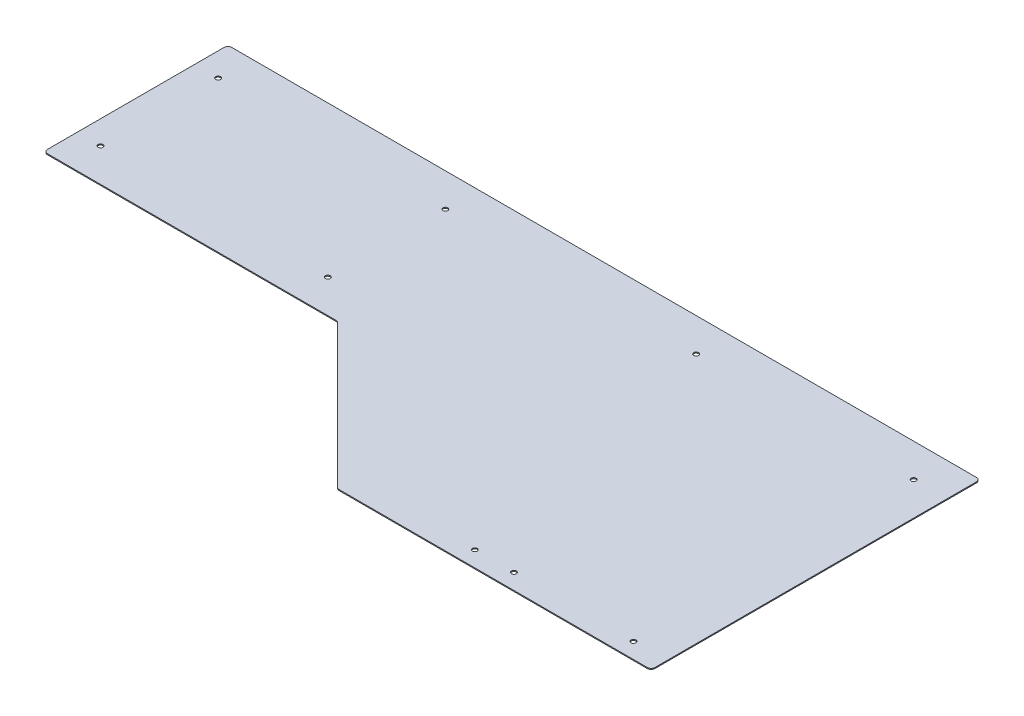
ISO-10303-21;
HEADER;
FILE_DESCRIPTION(('STEP AP214'),'2;1');
FILE_NAME('part.step','',(''),(''),'','','');
FILE_SCHEMA(('AUTOMOTIVE_DESIGN { 1 0 10303 214 1 1 1 1 }'));
ENDSEC;
DATA;
#1=APPLICATION_CONTEXT('core data for automotive mechanical design processes');
#2=APPLICATION_PROTOCOL_DEFINITION('international standard','automotive_design',2000,#1);
#3=PRODUCT_CONTEXT('',#1,'mechanical');
#4=PRODUCT('Part','Part','',(#3));
#5=PRODUCT_RELATED_PRODUCT_CATEGORY('part','',(#4));
#6=PRODUCT_DEFINITION_FORMATION('','',#4);
#7=PRODUCT_DEFINITION_CONTEXT('part definition',#1,'design');
#8=PRODUCT_DEFINITION('design','',#6,#7);
#9=PRODUCT_DEFINITION_SHAPE('','',#8);
#10=(LENGTH_UNIT() NAMED_UNIT(*) SI_UNIT(.MILLI.,.METRE.));
#11=(NAMED_UNIT(*) PLANE_ANGLE_UNIT() SI_UNIT($,.RADIAN.));
#12=(NAMED_UNIT(*) SI_UNIT($,.STERADIAN.) SOLID_ANGLE_UNIT());
#13=UNCERTAINTY_MEASURE_WITH_UNIT(LENGTH_MEASURE(1.E-05),#10,'distance_accuracy_value','');
#14=(GEOMETRIC_REPRESENTATION_CONTEXT(3) GLOBAL_UNCERTAINTY_ASSIGNED_CONTEXT((#13)) GLOBAL_UNIT_ASSIGNED_CONTEXT((#10,
#11,#12)) REPRESENTATION_CONTEXT('',''));
#15=CARTESIAN_POINT('',(0.,0.,0.));
#16=DIRECTION('',(0.,0.,1.));
#17=DIRECTION('',(1.,0.,0.));
#18=AXIS2_PLACEMENT_3D('',#15,#16,#17);
#19=CARTESIAN_POINT('',(-505.369743878931,1.5875,-6.35));
#20=DIRECTION('',(0.,-1.,0.));
#21=DIRECTION('',(0.,0.,-1.));
#22=AXIS2_PLACEMENT_3D('',#19,#20,#21);
#23=CYLINDRICAL_SURFACE('',#22,6.35000000000002);
#24=CARTESIAN_POINT('',(-505.369743878931,0.,-6.35));
#25=DIRECTION('',(0.,1.,0.));
#26=DIRECTION('',(0.,0.,-1.));
#27=AXIS2_PLACEMENT_3D('',#24,#25,#26);
#28=CIRCLE('',#27,6.35000000000002);
#29=CARTESIAN_POINT('',(-509.859871939465,0.,-1.8598719394654));
#30=VERTEX_POINT('',#29);
#31=CARTESIAN_POINT('',(-505.369743878931,0.,0.));
#32=VERTEX_POINT('',#31);
#33=EDGE_CURVE('E149',#30,#32,#28,.T.);
#34=ORIENTED_EDGE('',*,*,#33,.T.);
#35=DIRECTION('',(0.,-1.,0.));
#36=VECTOR('',#35,1.);
#37=CARTESIAN_POINT('',(-505.369743878931,1.5875,0.));
#38=LINE('',#37,#36);
#39=CARTESIAN_POINT('',(-505.369743878931,1.5875,0.));
#40=VERTEX_POINT('',#39);
#41=EDGE_CURVE('E131',#40,#32,#38,.T.);
#42=ORIENTED_EDGE('',*,*,#41,.F.);
#43=CARTESIAN_POINT('',(-505.369743878931,1.5875,-6.35));
#44=DIRECTION('',(0.,1.,0.));
#45=DIRECTION('',(0.,0.,-1.));
#46=AXIS2_PLACEMENT_3D('',#43,#44,#45);
#47=CIRCLE('',#46,6.35000000000002);
#48=CARTESIAN_POINT('',(-509.859871939465,1.5875,-1.8598719394654));
#49=VERTEX_POINT('',#48);
#50=EDGE_CURVE('E136',#49,#40,#47,.T.);
#51=ORIENTED_EDGE('',*,*,#50,.F.);
#52=DIRECTION('',(0.,-1.,0.));
#53=VECTOR('',#52,1.);
#54=CARTESIAN_POINT('',(-509.859871939465,1.5875,-1.8598719394654));
#55=LINE('',#54,#53);
#56=EDGE_CURVE('E219',#49,#30,#55,.T.);
#57=ORIENTED_EDGE('',*,*,#56,.T.);
#58=EDGE_LOOP('',(#34,#42,#51,#57));
#59=FACE_BOUND('',#58,.T.);
#60=ADVANCED_FACE('F36',(#59),#23,.T.);
#61=CARTESIAN_POINT('',(-505.369743878931,1.5875,0.));
#62=DIRECTION('',(0.,0.,-1.));
#63=DIRECTION('',(-1.,0.,0.));
#64=AXIS2_PLACEMENT_3D('',#61,#62,#63);
#65=PLANE('',#64);
#66=DIRECTION('',(1.,0.,0.));
#67=VECTOR('',#66,1.);
#68=CARTESIAN_POINT('',(-505.369743878931,0.,0.));
#69=LINE('',#68,#67);
#70=CARTESIAN_POINT('',(-6.35000000000002,0.,0.));
#71=VERTEX_POINT('',#70);
#72=EDGE_CURVE('E211',#32,#71,#69,.T.);
#73=ORIENTED_EDGE('',*,*,#72,.T.);
#74=DIRECTION('',(0.,-1.,0.));
#75=VECTOR('',#74,1.);
#76=CARTESIAN_POINT('',(-6.35000000000002,1.5875,0.));
#77=LINE('',#76,#75);
#78=CARTESIAN_POINT('',(-6.35000000000002,1.5875,0.));
#79=VERTEX_POINT('',#78);
#80=EDGE_CURVE('E11',#71,#79,#77,.F.);
#81=ORIENTED_EDGE('',*,*,#80,.T.);
#82=DIRECTION('',(1.,0.,0.));
#83=VECTOR('',#82,1.);
#84=CARTESIAN_POINT('',(-505.369743878931,1.5875,0.));
#85=LINE('',#84,#83);
#86=EDGE_CURVE('E126',#40,#79,#85,.T.);
#87=ORIENTED_EDGE('',*,*,#86,.F.);
#88=ORIENTED_EDGE('',*,*,#41,.T.);
#89=EDGE_LOOP('',(#73,#81,#87,#88));
#90=FACE_BOUND('',#89,.T.);
#91=ADVANCED_FACE('F129',(#90),#65,.F.);
#92=CARTESIAN_POINT('',(0.,1.5875,0.));
#93=DIRECTION('',(-1.,0.,0.));
#94=DIRECTION('',(0.,0.,1.));
#95=AXIS2_PLACEMENT_3D('',#92,#93,#94);
#96=PLANE('',#95);
#97=DIRECTION('',(0.,0.,-1.));
#98=VECTOR('',#97,1.);
#99=CARTESIAN_POINT('',(0.,0.,0.));
#100=LINE('',#99,#98);
#101=CARTESIAN_POINT('',(0.,0.,-6.35));
#102=VERTEX_POINT('',#101);
#103=CARTESIAN_POINT('',(0.,0.,-527.05));
#104=VERTEX_POINT('',#103);
#105=EDGE_CURVE('E193',#102,#104,#100,.T.);
#106=ORIENTED_EDGE('',*,*,#105,.T.);
#107=DIRECTION('',(0.,-1.,0.));
#108=VECTOR('',#107,1.);
#109=CARTESIAN_POINT('',(0.,1.5875,-527.05));
#110=LINE('',#109,#108);
#111=CARTESIAN_POINT('',(0.,1.5875,-527.05));
#112=VERTEX_POINT('',#111);
#113=EDGE_CURVE('E44',#104,#112,#110,.F.);
#114=ORIENTED_EDGE('',*,*,#113,.T.);
#115=DIRECTION('',(0.,0.,-1.));
#116=VECTOR('',#115,1.);
#117=CARTESIAN_POINT('',(0.,1.5875,0.));
#118=LINE('',#117,#116);
#119=CARTESIAN_POINT('',(0.,1.5875,-6.35));
#120=VERTEX_POINT('',#119);
#121=EDGE_CURVE('E135',#120,#112,#118,.T.);
#122=ORIENTED_EDGE('',*,*,#121,.F.);
#123=DIRECTION('',(0.,-1.,0.));
#124=VECTOR('',#123,1.);
#125=CARTESIAN_POINT('',(0.,1.5875,-6.35));
#126=LINE('',#125,#124);
#127=EDGE_CURVE('E184',#120,#102,#126,.T.);
#128=ORIENTED_EDGE('',*,*,#127,.T.);
#129=EDGE_LOOP('',(#106,#114,#122,#128));
#130=FACE_BOUND('',#129,.T.);
#131=ADVANCED_FACE('F190',(#130),#96,.F.);
#132=CARTESIAN_POINT('',(-1219.2,1.5875,-533.4));
#133=DIRECTION('',(0.,0.,1.));
#134=DIRECTION('',(1.,0.,0.));
#135=AXIS2_PLACEMENT_3D('',#132,#133,#134);
#136=PLANE('',#135);
#137=DIRECTION('',(-1.,0.,0.));
#138=VECTOR('',#137,1.);
#139=CARTESIAN_POINT('',(-1219.2,1.5875,-533.4));
#140=LINE('',#139,#138);
#141=CARTESIAN_POINT('',(-6.35000000000052,1.5875,-533.4));
#142=VERTEX_POINT('',#141);
#143=CARTESIAN_POINT('',(-1212.85,1.5875,-533.4));
#144=VERTEX_POINT('',#143);
#145=EDGE_CURVE('E195',#142,#144,#140,.T.);
#146=ORIENTED_EDGE('',*,*,#145,.F.);
#147=DIRECTION('',(0.,-1.,0.));
#148=VECTOR('',#147,1.);
#149=CARTESIAN_POINT('',(-6.35000000000008,1.5875,-533.4));
#150=LINE('',#149,#148);
#151=CARTESIAN_POINT('',(-6.35000000000052,0.,-533.4));
#152=VERTEX_POINT('',#151);
#153=EDGE_CURVE('E181',#142,#152,#150,.T.);
#154=ORIENTED_EDGE('',*,*,#153,.T.);
#155=DIRECTION('',(-1.,0.,0.));
#156=VECTOR('',#155,1.);
#157=CARTESIAN_POINT('',(-1219.2,0.,-533.4));
#158=LINE('',#157,#156);
#159=CARTESIAN_POINT('',(-1212.85,0.,-533.4));
#160=VERTEX_POINT('',#159);
#161=EDGE_CURVE('E201',#152,#160,#158,.T.);
#162=ORIENTED_EDGE('',*,*,#161,.T.);
#163=DIRECTION('',(0.,-1.,0.));
#164=VECTOR('',#163,1.);
#165=CARTESIAN_POINT('',(-1212.85,1.5875,-533.4));
#166=LINE('',#165,#164);
#167=EDGE_CURVE('E51',#160,#144,#166,.F.);
#168=ORIENTED_EDGE('',*,*,#167,.T.);
#169=EDGE_LOOP('',(#146,#154,#162,#168));
#170=FACE_BOUND('',#169,.T.);
#171=ADVANCED_FACE('F200',(#170),#136,.F.);
#172=CARTESIAN_POINT('',(-1219.2,1.5875,-234.95));
#173=DIRECTION('',(1.,0.,0.));
#174=DIRECTION('',(0.,0.,-1.));
#175=AXIS2_PLACEMENT_3D('',#172,#173,#174);
#176=PLANE('',#175);
#177=DIRECTION('',(0.,0.,1.));
#178=VECTOR('',#177,1.);
#179=CARTESIAN_POINT('',(-1219.2,0.,-234.95));
#180=LINE('',#179,#178);
#181=CARTESIAN_POINT('',(-1219.2,0.,-527.05));
#182=VERTEX_POINT('',#181);
#183=CARTESIAN_POINT('',(-1219.2,0.,-241.3));
#184=VERTEX_POINT('',#183);
#185=EDGE_CURVE('E206',#182,#184,#180,.T.);
#186=ORIENTED_EDGE('',*,*,#185,.T.);
#187=DIRECTION('',(0.,-1.,0.));
#188=VECTOR('',#187,1.);
#189=CARTESIAN_POINT('',(-1219.2,1.5875,-241.3));
#190=LINE('',#189,#188);
#191=CARTESIAN_POINT('',(-1219.2,1.5875,-241.3));
#192=VERTEX_POINT('',#191);
#193=EDGE_CURVE('E171',#184,#192,#190,.F.);
#194=ORIENTED_EDGE('',*,*,#193,.T.);
#195=DIRECTION('',(0.,0.,1.));
#196=VECTOR('',#195,1.);
#197=CARTESIAN_POINT('',(-1219.2,1.5875,-234.95));
#198=LINE('',#197,#196);
#199=CARTESIAN_POINT('',(-1219.2,1.5875,-527.05));
#200=VERTEX_POINT('',#199);
#201=EDGE_CURVE('E239',#200,#192,#198,.T.);
#202=ORIENTED_EDGE('',*,*,#201,.F.);
#203=DIRECTION('',(0.,-1.,0.));
#204=VECTOR('',#203,1.);
#205=CARTESIAN_POINT('',(-1219.2,1.5875,-527.05));
#206=LINE('',#205,#204);
#207=EDGE_CURVE('E168',#200,#182,#206,.T.);
#208=ORIENTED_EDGE('',*,*,#207,.T.);
#209=EDGE_LOOP('',(#186,#194,#202,#208));
#210=FACE_BOUND('',#209,.T.);
#211=ADVANCED_FACE('F356',(#210),#176,.F.);
#212=CARTESIAN_POINT('',(-1219.2,1.5875,-234.95));
#213=DIRECTION('',(0.,0.,-1.));
#214=DIRECTION('',(-1.,0.,0.));
#215=AXIS2_PLACEMENT_3D('',#212,#213,#214);
#216=PLANE('',#215);
#217=DIRECTION('',(1.,0.,0.));
#218=VECTOR('',#217,1.);
#219=CARTESIAN_POINT('',(-1219.2,1.5875,-234.95));
#220=LINE('',#219,#218);
#221=CARTESIAN_POINT('',(-1212.85,1.5875,-234.95));
#222=VERTEX_POINT('',#221);
#223=CARTESIAN_POINT('',(-745.580256121068,1.5875,-234.95));
#224=VERTEX_POINT('',#223);
#225=EDGE_CURVE('E237',#222,#224,#220,.T.);
#226=ORIENTED_EDGE('',*,*,#225,.F.);
#227=DIRECTION('',(0.,-1.,0.));
#228=VECTOR('',#227,1.);
#229=CARTESIAN_POINT('',(-1212.85,1.5875,-234.95));
#230=LINE('',#229,#228);
#231=CARTESIAN_POINT('',(-1212.85,0.,-234.95));
#232=VERTEX_POINT('',#231);
#233=EDGE_CURVE('E150',#222,#232,#230,.T.);
#234=ORIENTED_EDGE('',*,*,#233,.T.);
#235=DIRECTION('',(1.,0.,0.));
#236=VECTOR('',#235,1.);
#237=CARTESIAN_POINT('',(-1219.2,0.,-234.95));
#238=LINE('',#237,#236);
#239=CARTESIAN_POINT('',(-745.580256121068,0.,-234.95));
#240=VERTEX_POINT('',#239);
#241=EDGE_CURVE('E209',#232,#240,#238,.T.);
#242=ORIENTED_EDGE('',*,*,#241,.T.);
#243=DIRECTION('',(0.,-1.,0.));
#244=VECTOR('',#243,1.);
#245=CARTESIAN_POINT('',(-745.580256121068,1.5875,-234.95));
#246=LINE('',#245,#244);
#247=EDGE_CURVE('E151',#224,#240,#246,.T.);
#248=ORIENTED_EDGE('',*,*,#247,.F.);
#249=EDGE_LOOP('',(#226,#234,#242,#248));
#250=FACE_BOUND('',#249,.T.);
#251=ADVANCED_FACE('F362',(#250),#216,.F.);
#252=CARTESIAN_POINT('',(-745.580256121068,1.5875,-228.6));
#253=DIRECTION('',(0.,-1.,0.));
#254=DIRECTION('',(0.,0.,-1.));
#255=AXIS2_PLACEMENT_3D('',#252,#253,#254);
#256=CYLINDRICAL_SURFACE('',#255,6.35);
#257=CARTESIAN_POINT('',(-745.580256121068,0.,-228.6));
#258=DIRECTION('',(0.,-1.,0.));
#259=DIRECTION('',(0.,0.,1.));
#260=AXIS2_PLACEMENT_3D('',#257,#258,#259);
#261=CIRCLE('',#260,6.35);
#262=CARTESIAN_POINT('',(-741.090128060534,0.,-233.090128060535));
#263=VERTEX_POINT('',#262);
#264=EDGE_CURVE('E216',#240,#263,#261,.T.);
#265=ORIENTED_EDGE('',*,*,#264,.T.);
#266=DIRECTION('',(0.,-1.,0.));
#267=VECTOR('',#266,1.);
#268=CARTESIAN_POINT('',(-741.090128060534,1.5875,-233.090128060535));
#269=LINE('',#268,#267);
#270=CARTESIAN_POINT('',(-741.090128060534,1.5875,-233.090128060535));
#271=VERTEX_POINT('',#270);
#272=EDGE_CURVE('E157',#271,#263,#269,.T.);
#273=ORIENTED_EDGE('',*,*,#272,.F.);
#274=CARTESIAN_POINT('',(-745.580256121068,1.5875,-228.6));
#275=DIRECTION('',(0.,-1.,0.));
#276=DIRECTION('',(0.,0.,1.));
#277=AXIS2_PLACEMENT_3D('',#274,#275,#276);
#278=CIRCLE('',#277,6.35);
#279=EDGE_CURVE('E235',#224,#271,#278,.T.);
#280=ORIENTED_EDGE('',*,*,#279,.F.);
#281=ORIENTED_EDGE('',*,*,#247,.T.);
#282=EDGE_LOOP('',(#265,#273,#280,#281));
#283=FACE_BOUND('',#282,.T.);
#284=ADVANCED_FACE('F363',(#283),#256,.F.);
#285=CARTESIAN_POINT('',(-741.090128060534,1.5875,-233.090128060535));
#286=DIRECTION('',(0.707106781186549,0.,-0.707106781186546));
#287=DIRECTION('',(-0.707106781186546,0.,-0.707106781186549));
#288=AXIS2_PLACEMENT_3D('',#285,#286,#287);
#289=PLANE('',#288);
#290=DIRECTION('',(0.707106781186546,0.,0.707106781186549));
#291=VECTOR('',#290,1.);
#292=CARTESIAN_POINT('',(-741.090128060534,0.,-233.090128060535));
#293=LINE('',#292,#291);
#294=EDGE_CURVE('E146',#263,#30,#293,.T.);
#295=ORIENTED_EDGE('',*,*,#294,.T.);
#296=ORIENTED_EDGE('',*,*,#56,.F.);
#297=DIRECTION('',(0.707106781186546,0.,0.707106781186549));
#298=VECTOR('',#297,1.);
#299=CARTESIAN_POINT('',(-741.090128060534,1.5875,-233.090128060535));
#300=LINE('',#299,#298);
#301=EDGE_CURVE('E142',#271,#49,#300,.T.);
#302=ORIENTED_EDGE('',*,*,#301,.F.);
#303=ORIENTED_EDGE('',*,*,#272,.T.);
#304=EDGE_LOOP('',(#295,#296,#302,#303));
#305=FACE_BOUND('',#304,.T.);
#306=ADVANCED_FACE('F224',(#305),#289,.F.);
#307=CARTESIAN_POINT('',(-505.369743878931,1.5875,-6.35));
#308=DIRECTION('',(0.,-1.,0.));
#309=DIRECTION('',(0.,0.,-1.));
#310=AXIS2_PLACEMENT_3D('',#307,#308,#309);
#311=PLANE('',#310);
#312=CARTESIAN_POINT('',(-1181.1,1.5875,-479.425));
#313=DIRECTION('',(0.,1.,0.));
#314=DIRECTION('',(0.,0.,1.));
#315=AXIS2_PLACEMENT_3D('',#312,#313,#314);
#316=CIRCLE('',#315,3.96875000000008);
#317=CARTESIAN_POINT('',(-1181.1,1.5875,-475.45625));
#318=VERTEX_POINT('',#317);
#319=EDGE_CURVE('E289',#318,#318,#316,.T.);
#320=ORIENTED_EDGE('',*,*,#319,.F.);
#321=EDGE_LOOP('',(#320));
#322=FACE_BOUND('',#321,.T.);
#323=CARTESIAN_POINT('',(-1181.1,1.5875,-288.925));
#324=DIRECTION('',(0.,1.,0.));
#325=DIRECTION('',(0.,0.,1.));
#326=AXIS2_PLACEMENT_3D('',#323,#324,#325);
#327=CIRCLE('',#326,3.96875000000008);
#328=CARTESIAN_POINT('',(-1181.1,1.5875,-284.95625));
#329=VERTEX_POINT('',#328);
#330=EDGE_CURVE('E283',#329,#329,#327,.T.);
#331=ORIENTED_EDGE('',*,*,#330,.F.);
#332=EDGE_LOOP('',(#331));
#333=FACE_BOUND('',#332,.T.);
#334=CARTESIAN_POINT('',(-812.8,1.5875,-288.925));
#335=DIRECTION('',(0.,1.,0.));
#336=DIRECTION('',(0.,0.,1.));
#337=AXIS2_PLACEMENT_3D('',#334,#335,#336);
#338=CIRCLE('',#337,3.96874999999997);
#339=CARTESIAN_POINT('',(-812.8,1.5875,-284.95625));
#340=VERTEX_POINT('',#339);
#341=EDGE_CURVE('E277',#340,#340,#338,.T.);
#342=ORIENTED_EDGE('',*,*,#341,.F.);
#343=EDGE_LOOP('',(#342));
#344=FACE_BOUND('',#343,.T.);
#345=CARTESIAN_POINT('',(-812.8,1.5875,-479.425));
#346=DIRECTION('',(0.,1.,0.));
#347=DIRECTION('',(0.,0.,1.));
#348=AXIS2_PLACEMENT_3D('',#345,#346,#347);
#349=CIRCLE('',#348,3.96874999999997);
#350=CARTESIAN_POINT('',(-812.8,1.5875,-475.45625));
#351=VERTEX_POINT('',#350);
#352=EDGE_CURVE('E271',#351,#351,#349,.T.);
#353=ORIENTED_EDGE('',*,*,#352,.F.);
#354=EDGE_LOOP('',(#353));
#355=FACE_BOUND('',#354,.T.);
#356=CARTESIAN_POINT('',(-406.4,1.5875,-479.425));
#357=DIRECTION('',(0.,1.,0.));
#358=DIRECTION('',(0.,0.,1.));
#359=AXIS2_PLACEMENT_3D('',#356,#357,#358);
#360=CIRCLE('',#359,3.96875000000002);
#361=CARTESIAN_POINT('',(-406.4,1.5875,-475.45625));
#362=VERTEX_POINT('',#361);
#363=EDGE_CURVE('E265',#362,#362,#360,.T.);
#364=ORIENTED_EDGE('',*,*,#363,.F.);
#365=EDGE_LOOP('',(#364));
#366=FACE_BOUND('',#365,.T.);
#367=CARTESIAN_POINT('',(-53.975,1.5875,-479.425));
#368=DIRECTION('',(0.,1.,0.));
#369=DIRECTION('',(0.,0.,1.));
#370=AXIS2_PLACEMENT_3D('',#367,#368,#369);
#371=CIRCLE('',#370,3.96874999999999);
#372=CARTESIAN_POINT('',(-53.975,1.5875,-475.45625));
#373=VERTEX_POINT('',#372);
#374=EDGE_CURVE('E259',#373,#373,#371,.T.);
#375=ORIENTED_EDGE('',*,*,#374,.F.);
#376=EDGE_LOOP('',(#375));
#377=FACE_BOUND('',#376,.T.);
#378=CARTESIAN_POINT('',(-53.975,1.5875,-25.4));
#379=DIRECTION('',(0.,1.,0.));
#380=DIRECTION('',(0.,0.,1.));
#381=AXIS2_PLACEMENT_3D('',#378,#379,#380);
#382=CIRCLE('',#381,3.96874999999999);
#383=CARTESIAN_POINT('',(-53.975,1.5875,-21.43125));
#384=VERTEX_POINT('',#383);
#385=EDGE_CURVE('E253',#384,#384,#382,.T.);
#386=ORIENTED_EDGE('',*,*,#385,.F.);
#387=EDGE_LOOP('',(#386));
#388=FACE_BOUND('',#387,.T.);
#389=CARTESIAN_POINT('',(-247.65,1.5875,-25.4));
#390=DIRECTION('',(0.,1.,0.));
#391=DIRECTION('',(0.,0.,1.));
#392=AXIS2_PLACEMENT_3D('',#389,#390,#391);
#393=CIRCLE('',#392,3.96874999999999);
#394=CARTESIAN_POINT('',(-247.65,1.5875,-21.43125));
#395=VERTEX_POINT('',#394);
#396=EDGE_CURVE('E247',#395,#395,#393,.T.);
#397=ORIENTED_EDGE('',*,*,#396,.F.);
#398=EDGE_LOOP('',(#397));
#399=FACE_BOUND('',#398,.T.);
#400=CARTESIAN_POINT('',(-311.15,1.5875,-25.4));
#401=DIRECTION('',(0.,1.,0.));
#402=DIRECTION('',(0.,0.,1.));
#403=AXIS2_PLACEMENT_3D('',#400,#401,#402);
#404=CIRCLE('',#403,3.96875000000002);
#405=CARTESIAN_POINT('',(-311.15,1.5875,-21.43125));
#406=VERTEX_POINT('',#405);
#407=EDGE_CURVE('E231',#406,#406,#404,.T.);
#408=ORIENTED_EDGE('',*,*,#407,.F.);
#409=EDGE_LOOP('',(#408));
#410=FACE_BOUND('',#409,.T.);
#411=ORIENTED_EDGE('',*,*,#201,.T.);
#412=CARTESIAN_POINT('',(-1212.85,1.5875,-241.3));
#413=DIRECTION('',(0.,-1.,0.));
#414=DIRECTION('',(0.,0.,-1.));
#415=AXIS2_PLACEMENT_3D('',#412,#413,#414);
#416=CIRCLE('',#415,6.35);
#417=EDGE_CURVE('E178',#192,#222,#416,.F.);
#418=ORIENTED_EDGE('',*,*,#417,.T.);
#419=ORIENTED_EDGE('',*,*,#225,.T.);
#420=ORIENTED_EDGE('',*,*,#279,.T.);
#421=ORIENTED_EDGE('',*,*,#301,.T.);
#422=ORIENTED_EDGE('',*,*,#50,.T.);
#423=ORIENTED_EDGE('',*,*,#86,.T.);
#424=CARTESIAN_POINT('',(-6.35,1.5875,-6.35));
#425=DIRECTION('',(0.,-1.,0.));
#426=DIRECTION('',(0.,0.,-1.));
#427=AXIS2_PLACEMENT_3D('',#424,#425,#426);
#428=CIRCLE('',#427,6.35);
#429=EDGE_CURVE('E175',#79,#120,#428,.F.);
#430=ORIENTED_EDGE('',*,*,#429,.T.);
#431=ORIENTED_EDGE('',*,*,#121,.T.);
#432=CARTESIAN_POINT('',(-6.35000000000008,1.5875,-527.05));
#433=DIRECTION('',(0.,-1.,0.));
#434=DIRECTION('',(0.,0.,-1.));
#435=AXIS2_PLACEMENT_3D('',#432,#433,#434);
#436=CIRCLE('',#435,6.35);
#437=EDGE_CURVE('E58',#112,#142,#436,.F.);
#438=ORIENTED_EDGE('',*,*,#437,.T.);
#439=ORIENTED_EDGE('',*,*,#145,.T.);
#440=CARTESIAN_POINT('',(-1212.85,1.5875,-527.05));
#441=DIRECTION('',(0.,-1.,0.));
#442=DIRECTION('',(0.,0.,-1.));
#443=AXIS2_PLACEMENT_3D('',#440,#441,#442);
#444=CIRCLE('',#443,6.35);
#445=EDGE_CURVE('E173',#144,#200,#444,.F.);
#446=ORIENTED_EDGE('',*,*,#445,.T.);
#447=EDGE_LOOP('',(#411,#418,#419,#420,#421,#422,#423,#430,#431,#438,#439,#446));
#448=FACE_BOUND('',#447,.T.);
#449=ADVANCED_FACE('F140',(#322,#333,#344,#355,#366,#377,#388,#399,#410,#448),#311,.F.);
#450=CARTESIAN_POINT('',(-505.369743878931,0.,-6.35));
#451=DIRECTION('',(0.,-1.,0.));
#452=DIRECTION('',(0.,0.,-1.));
#453=AXIS2_PLACEMENT_3D('',#450,#451,#452);
#454=PLANE('',#453);
#455=CARTESIAN_POINT('',(-1181.1,0.,-479.425));
#456=DIRECTION('',(0.,1.,0.));
#457=DIRECTION('',(0.,0.,1.));
#458=AXIS2_PLACEMENT_3D('',#455,#456,#457);
#459=CIRCLE('',#458,3.96875000000008);
#460=CARTESIAN_POINT('',(-1181.1,0.,-475.45625));
#461=VERTEX_POINT('',#460);
#462=EDGE_CURVE('E286',#461,#461,#459,.T.);
#463=ORIENTED_EDGE('',*,*,#462,.T.);
#464=EDGE_LOOP('',(#463));
#465=FACE_BOUND('',#464,.T.);
#466=CARTESIAN_POINT('',(-1181.1,0.,-288.925));
#467=DIRECTION('',(0.,1.,0.));
#468=DIRECTION('',(0.,0.,1.));
#469=AXIS2_PLACEMENT_3D('',#466,#467,#468);
#470=CIRCLE('',#469,3.96875000000008);
#471=CARTESIAN_POINT('',(-1181.1,0.,-284.95625));
#472=VERTEX_POINT('',#471);
#473=EDGE_CURVE('E280',#472,#472,#470,.T.);
#474=ORIENTED_EDGE('',*,*,#473,.T.);
#475=EDGE_LOOP('',(#474));
#476=FACE_BOUND('',#475,.T.);
#477=CARTESIAN_POINT('',(-812.8,0.,-288.925));
#478=DIRECTION('',(0.,1.,0.));
#479=DIRECTION('',(0.,0.,1.));
#480=AXIS2_PLACEMENT_3D('',#477,#478,#479);
#481=CIRCLE('',#480,3.96874999999997);
#482=CARTESIAN_POINT('',(-812.8,0.,-284.95625));
#483=VERTEX_POINT('',#482);
#484=EDGE_CURVE('E274',#483,#483,#481,.T.);
#485=ORIENTED_EDGE('',*,*,#484,.T.);
#486=EDGE_LOOP('',(#485));
#487=FACE_BOUND('',#486,.T.);
#488=CARTESIAN_POINT('',(-812.8,0.,-479.425));
#489=DIRECTION('',(0.,1.,0.));
#490=DIRECTION('',(0.,0.,1.));
#491=AXIS2_PLACEMENT_3D('',#488,#489,#490);
#492=CIRCLE('',#491,3.96874999999997);
#493=CARTESIAN_POINT('',(-812.8,0.,-475.45625));
#494=VERTEX_POINT('',#493);
#495=EDGE_CURVE('E268',#494,#494,#492,.T.);
#496=ORIENTED_EDGE('',*,*,#495,.T.);
#497=EDGE_LOOP('',(#496));
#498=FACE_BOUND('',#497,.T.);
#499=CARTESIAN_POINT('',(-406.4,0.,-479.425));
#500=DIRECTION('',(0.,1.,0.));
#501=DIRECTION('',(0.,0.,1.));
#502=AXIS2_PLACEMENT_3D('',#499,#500,#501);
#503=CIRCLE('',#502,3.96875000000002);
#504=CARTESIAN_POINT('',(-406.4,0.,-475.45625));
#505=VERTEX_POINT('',#504);
#506=EDGE_CURVE('E262',#505,#505,#503,.T.);
#507=ORIENTED_EDGE('',*,*,#506,.T.);
#508=EDGE_LOOP('',(#507));
#509=FACE_BOUND('',#508,.T.);
#510=CARTESIAN_POINT('',(-53.975,0.,-479.425));
#511=DIRECTION('',(0.,1.,0.));
#512=DIRECTION('',(0.,0.,1.));
#513=AXIS2_PLACEMENT_3D('',#510,#511,#512);
#514=CIRCLE('',#513,3.96875);
#515=CARTESIAN_POINT('',(-53.975,0.,-475.45625));
#516=VERTEX_POINT('',#515);
#517=EDGE_CURVE('E256',#516,#516,#514,.T.);
#518=ORIENTED_EDGE('',*,*,#517,.T.);
#519=EDGE_LOOP('',(#518));
#520=FACE_BOUND('',#519,.T.);
#521=CARTESIAN_POINT('',(-53.975,0.,-25.4));
#522=DIRECTION('',(0.,1.,0.));
#523=DIRECTION('',(0.,0.,1.));
#524=AXIS2_PLACEMENT_3D('',#521,#522,#523);
#525=CIRCLE('',#524,3.96875);
#526=CARTESIAN_POINT('',(-53.975,0.,-21.43125));
#527=VERTEX_POINT('',#526);
#528=EDGE_CURVE('E250',#527,#527,#525,.T.);
#529=ORIENTED_EDGE('',*,*,#528,.T.);
#530=EDGE_LOOP('',(#529));
#531=FACE_BOUND('',#530,.T.);
#532=CARTESIAN_POINT('',(-247.65,0.,-25.4));
#533=DIRECTION('',(0.,1.,0.));
#534=DIRECTION('',(0.,0.,1.));
#535=AXIS2_PLACEMENT_3D('',#532,#533,#534);
#536=CIRCLE('',#535,3.96874999999999);
#537=CARTESIAN_POINT('',(-247.65,0.,-21.43125));
#538=VERTEX_POINT('',#537);
#539=EDGE_CURVE('E244',#538,#538,#536,.T.);
#540=ORIENTED_EDGE('',*,*,#539,.T.);
#541=EDGE_LOOP('',(#540));
#542=FACE_BOUND('',#541,.T.);
#543=CARTESIAN_POINT('',(-311.15,0.,-25.4));
#544=DIRECTION('',(0.,1.,0.));
#545=DIRECTION('',(0.,0.,1.));
#546=AXIS2_PLACEMENT_3D('',#543,#544,#545);
#547=CIRCLE('',#546,3.96875000000002);
#548=CARTESIAN_POINT('',(-311.15,0.,-21.43125));
#549=VERTEX_POINT('',#548);
#550=EDGE_CURVE('E228',#549,#549,#547,.T.);
#551=ORIENTED_EDGE('',*,*,#550,.T.);
#552=EDGE_LOOP('',(#551));
#553=FACE_BOUND('',#552,.T.);
#554=ORIENTED_EDGE('',*,*,#241,.F.);
#555=CARTESIAN_POINT('',(-1212.85,0.,-241.3));
#556=DIRECTION('',(0.,-1.,0.));
#557=DIRECTION('',(0.,0.,-1.));
#558=AXIS2_PLACEMENT_3D('',#555,#556,#557);
#559=CIRCLE('',#558,6.35);
#560=EDGE_CURVE('E166',#232,#184,#559,.T.);
#561=ORIENTED_EDGE('',*,*,#560,.T.);
#562=ORIENTED_EDGE('',*,*,#185,.F.);
#563=CARTESIAN_POINT('',(-1212.85,0.,-527.05));
#564=DIRECTION('',(0.,-1.,0.));
#565=DIRECTION('',(0.,0.,-1.));
#566=AXIS2_PLACEMENT_3D('',#563,#564,#565);
#567=CIRCLE('',#566,6.35);
#568=EDGE_CURVE('E154',#182,#160,#567,.T.);
#569=ORIENTED_EDGE('',*,*,#568,.T.);
#570=ORIENTED_EDGE('',*,*,#161,.F.);
#571=CARTESIAN_POINT('',(-6.35000000000008,0.,-527.05));
#572=DIRECTION('',(0.,-1.,0.));
#573=DIRECTION('',(0.,0.,-1.));
#574=AXIS2_PLACEMENT_3D('',#571,#572,#573);
#575=CIRCLE('',#574,6.35);
#576=EDGE_CURVE('E164',#152,#104,#575,.T.);
#577=ORIENTED_EDGE('',*,*,#576,.T.);
#578=ORIENTED_EDGE('',*,*,#105,.F.);
#579=CARTESIAN_POINT('',(-6.35,0.,-6.35));
#580=DIRECTION('',(0.,-1.,0.));
#581=DIRECTION('',(0.,0.,-1.));
#582=AXIS2_PLACEMENT_3D('',#579,#580,#581);
#583=CIRCLE('',#582,6.35);
#584=EDGE_CURVE('E162',#102,#71,#583,.T.);
#585=ORIENTED_EDGE('',*,*,#584,.T.);
#586=ORIENTED_EDGE('',*,*,#72,.F.);
#587=ORIENTED_EDGE('',*,*,#33,.F.);
#588=ORIENTED_EDGE('',*,*,#294,.F.);
#589=ORIENTED_EDGE('',*,*,#264,.F.);
#590=EDGE_LOOP('',(#554,#561,#562,#569,#570,#577,#578,#585,#586,#587,#588,#589));
#591=FACE_BOUND('',#590,.T.);
#592=ADVANCED_FACE('F204',(#465,#476,#487,#498,#509,#520,#531,#542,#553,#591),#454,.T.);
#593=CARTESIAN_POINT('',(-311.15,1.5875,-25.4));
#594=DIRECTION('',(0.,1.,0.));
#595=DIRECTION('',(0.,0.,1.));
#596=AXIS2_PLACEMENT_3D('',#593,#594,#595);
#597=CYLINDRICAL_SURFACE('',#596,3.96875000000002);
#598=ORIENTED_EDGE('',*,*,#550,.F.);
#599=EDGE_LOOP('',(#598));
#600=FACE_BOUND('',#599,.T.);
#601=ORIENTED_EDGE('',*,*,#407,.T.);
#602=EDGE_LOOP('',(#601));
#603=FACE_BOUND('',#602,.T.);
#604=ADVANCED_FACE('F314',(#600,#603),#597,.F.);
#605=CARTESIAN_POINT('',(-247.65,1.5875,-25.4));
#606=DIRECTION('',(0.,1.,0.));
#607=DIRECTION('',(0.,0.,1.));
#608=AXIS2_PLACEMENT_3D('',#605,#606,#607);
#609=CYLINDRICAL_SURFACE('',#608,3.96874999999999);
#610=ORIENTED_EDGE('',*,*,#539,.F.);
#611=EDGE_LOOP('',(#610));
#612=FACE_BOUND('',#611,.T.);
#613=ORIENTED_EDGE('',*,*,#396,.T.);
#614=EDGE_LOOP('',(#613));
#615=FACE_BOUND('',#614,.T.);
#616=ADVANCED_FACE('F316',(#612,#615),#609,.F.);
#617=CARTESIAN_POINT('',(-53.975,1.5875,-25.4));
#618=DIRECTION('',(0.,1.,0.));
#619=DIRECTION('',(0.,0.,1.));
#620=AXIS2_PLACEMENT_3D('',#617,#618,#619);
#621=CYLINDRICAL_SURFACE('',#620,3.96875);
#622=ORIENTED_EDGE('',*,*,#528,.F.);
#623=EDGE_LOOP('',(#622));
#624=FACE_BOUND('',#623,.T.);
#625=ORIENTED_EDGE('',*,*,#385,.T.);
#626=EDGE_LOOP('',(#625));
#627=FACE_BOUND('',#626,.T.);
#628=ADVANCED_FACE('F323',(#624,#627),#621,.F.);
#629=CARTESIAN_POINT('',(-53.975,1.5875,-479.425));
#630=DIRECTION('',(0.,1.,0.));
#631=DIRECTION('',(0.,0.,1.));
#632=AXIS2_PLACEMENT_3D('',#629,#630,#631);
#633=CYLINDRICAL_SURFACE('',#632,3.96875);
#634=ORIENTED_EDGE('',*,*,#517,.F.);
#635=EDGE_LOOP('',(#634));
#636=FACE_BOUND('',#635,.T.);
#637=ORIENTED_EDGE('',*,*,#374,.T.);
#638=EDGE_LOOP('',(#637));
#639=FACE_BOUND('',#638,.T.);
#640=ADVANCED_FACE('F468',(#636,#639),#633,.F.);
#641=CARTESIAN_POINT('',(-406.4,1.5875,-479.425));
#642=DIRECTION('',(0.,1.,0.));
#643=DIRECTION('',(0.,0.,1.));
#644=AXIS2_PLACEMENT_3D('',#641,#642,#643);
#645=CYLINDRICAL_SURFACE('',#644,3.96875000000002);
#646=ORIENTED_EDGE('',*,*,#506,.F.);
#647=EDGE_LOOP('',(#646));
#648=FACE_BOUND('',#647,.T.);
#649=ORIENTED_EDGE('',*,*,#363,.T.);
#650=EDGE_LOOP('',(#649));
#651=FACE_BOUND('',#650,.T.);
#652=ADVANCED_FACE('F460',(#648,#651),#645,.F.);
#653=CARTESIAN_POINT('',(-812.8,1.5875,-479.425));
#654=DIRECTION('',(0.,1.,0.));
#655=DIRECTION('',(0.,0.,1.));
#656=AXIS2_PLACEMENT_3D('',#653,#654,#655);
#657=CYLINDRICAL_SURFACE('',#656,3.96874999999997);
#658=ORIENTED_EDGE('',*,*,#495,.F.);
#659=EDGE_LOOP('',(#658));
#660=FACE_BOUND('',#659,.T.);
#661=ORIENTED_EDGE('',*,*,#352,.T.);
#662=EDGE_LOOP('',(#661));
#663=FACE_BOUND('',#662,.T.);
#664=ADVANCED_FACE('F452',(#660,#663),#657,.F.);
#665=CARTESIAN_POINT('',(-812.8,1.5875,-288.925));
#666=DIRECTION('',(0.,1.,0.));
#667=DIRECTION('',(0.,0.,1.));
#668=AXIS2_PLACEMENT_3D('',#665,#666,#667);
#669=CYLINDRICAL_SURFACE('',#668,3.96874999999997);
#670=ORIENTED_EDGE('',*,*,#484,.F.);
#671=EDGE_LOOP('',(#670));
#672=FACE_BOUND('',#671,.T.);
#673=ORIENTED_EDGE('',*,*,#341,.T.);
#674=EDGE_LOOP('',(#673));
#675=FACE_BOUND('',#674,.T.);
#676=ADVANCED_FACE('F444',(#672,#675),#669,.F.);
#677=CARTESIAN_POINT('',(-1181.1,1.5875,-288.925));
#678=DIRECTION('',(0.,1.,0.));
#679=DIRECTION('',(0.,0.,1.));
#680=AXIS2_PLACEMENT_3D('',#677,#678,#679);
#681=CYLINDRICAL_SURFACE('',#680,3.96875000000008);
#682=ORIENTED_EDGE('',*,*,#473,.F.);
#683=EDGE_LOOP('',(#682));
#684=FACE_BOUND('',#683,.T.);
#685=ORIENTED_EDGE('',*,*,#330,.T.);
#686=EDGE_LOOP('',(#685));
#687=FACE_BOUND('',#686,.T.);
#688=ADVANCED_FACE('F437',(#684,#687),#681,.F.);
#689=CARTESIAN_POINT('',(-1181.1,1.5875,-479.425));
#690=DIRECTION('',(0.,1.,0.));
#691=DIRECTION('',(0.,0.,1.));
#692=AXIS2_PLACEMENT_3D('',#689,#690,#691);
#693=CYLINDRICAL_SURFACE('',#692,3.96875000000008);
#694=ORIENTED_EDGE('',*,*,#462,.F.);
#695=EDGE_LOOP('',(#694));
#696=FACE_BOUND('',#695,.T.);
#697=ORIENTED_EDGE('',*,*,#319,.T.);
#698=EDGE_LOOP('',(#697));
#699=FACE_BOUND('',#698,.T.);
#700=ADVANCED_FACE('F293',(#696,#699),#693,.F.);
#701=CARTESIAN_POINT('',(-1212.85,1.5875,-241.3));
#702=DIRECTION('',(0.,-1.,0.));
#703=DIRECTION('',(0.,0.,-1.));
#704=AXIS2_PLACEMENT_3D('',#701,#702,#703);
#705=CYLINDRICAL_SURFACE('',#704,6.35);
#706=ORIENTED_EDGE('',*,*,#417,.F.);
#707=ORIENTED_EDGE('',*,*,#193,.F.);
#708=ORIENTED_EDGE('',*,*,#560,.F.);
#709=ORIENTED_EDGE('',*,*,#233,.F.);
#710=EDGE_LOOP('',(#706,#707,#708,#709));
#711=FACE_BOUND('',#710,.T.);
#712=ADVANCED_FACE('F337',(#711),#705,.T.);
#713=CARTESIAN_POINT('',(-6.35000000000008,1.5875,-527.05));
#714=DIRECTION('',(0.,-1.,0.));
#715=DIRECTION('',(0.,0.,-1.));
#716=AXIS2_PLACEMENT_3D('',#713,#714,#715);
#717=CYLINDRICAL_SURFACE('',#716,6.35);
#718=ORIENTED_EDGE('',*,*,#437,.F.);
#719=ORIENTED_EDGE('',*,*,#113,.F.);
#720=ORIENTED_EDGE('',*,*,#576,.F.);
#721=ORIENTED_EDGE('',*,*,#153,.F.);
#722=EDGE_LOOP('',(#718,#719,#720,#721));
#723=FACE_BOUND('',#722,.T.);
#724=ADVANCED_FACE('F198',(#723),#717,.T.);
#725=CARTESIAN_POINT('',(-6.35,1.5875,-6.35));
#726=DIRECTION('',(0.,-1.,0.));
#727=DIRECTION('',(0.,0.,-1.));
#728=AXIS2_PLACEMENT_3D('',#725,#726,#727);
#729=CYLINDRICAL_SURFACE('',#728,6.35);
#730=ORIENTED_EDGE('',*,*,#429,.F.);
#731=ORIENTED_EDGE('',*,*,#80,.F.);
#732=ORIENTED_EDGE('',*,*,#584,.F.);
#733=ORIENTED_EDGE('',*,*,#127,.F.);
#734=EDGE_LOOP('',(#730,#731,#732,#733));
#735=FACE_BOUND('',#734,.T.);
#736=ADVANCED_FACE('F342',(#735),#729,.T.);
#737=CARTESIAN_POINT('',(-1212.85,1.5875,-527.05));
#738=DIRECTION('',(0.,-1.,0.));
#739=DIRECTION('',(0.,0.,-1.));
#740=AXIS2_PLACEMENT_3D('',#737,#738,#739);
#741=CYLINDRICAL_SURFACE('',#740,6.35);
#742=ORIENTED_EDGE('',*,*,#445,.F.);
#743=ORIENTED_EDGE('',*,*,#167,.F.);
#744=ORIENTED_EDGE('',*,*,#568,.F.);
#745=ORIENTED_EDGE('',*,*,#207,.F.);
#746=EDGE_LOOP('',(#742,#743,#744,#745));
#747=FACE_BOUND('',#746,.T.);
#748=ADVANCED_FACE('F38',(#747),#741,.T.);
#749=CLOSED_SHELL('',(#60,#91,#131,#171,#211,#251,#284,#306,#449,#592,#604,#616,#628,#640,#652,
#664,#676,#688,#700,#712,#724,#736,#748));
#750=MANIFOLD_SOLID_BREP('B2',#749);
#751=ADVANCED_BREP_SHAPE_REPRESENTATION('',(#18,#750),#14);
#752=SHAPE_DEFINITION_REPRESENTATION(#9,#751);
ENDSEC;
END-ISO-10303-21;
